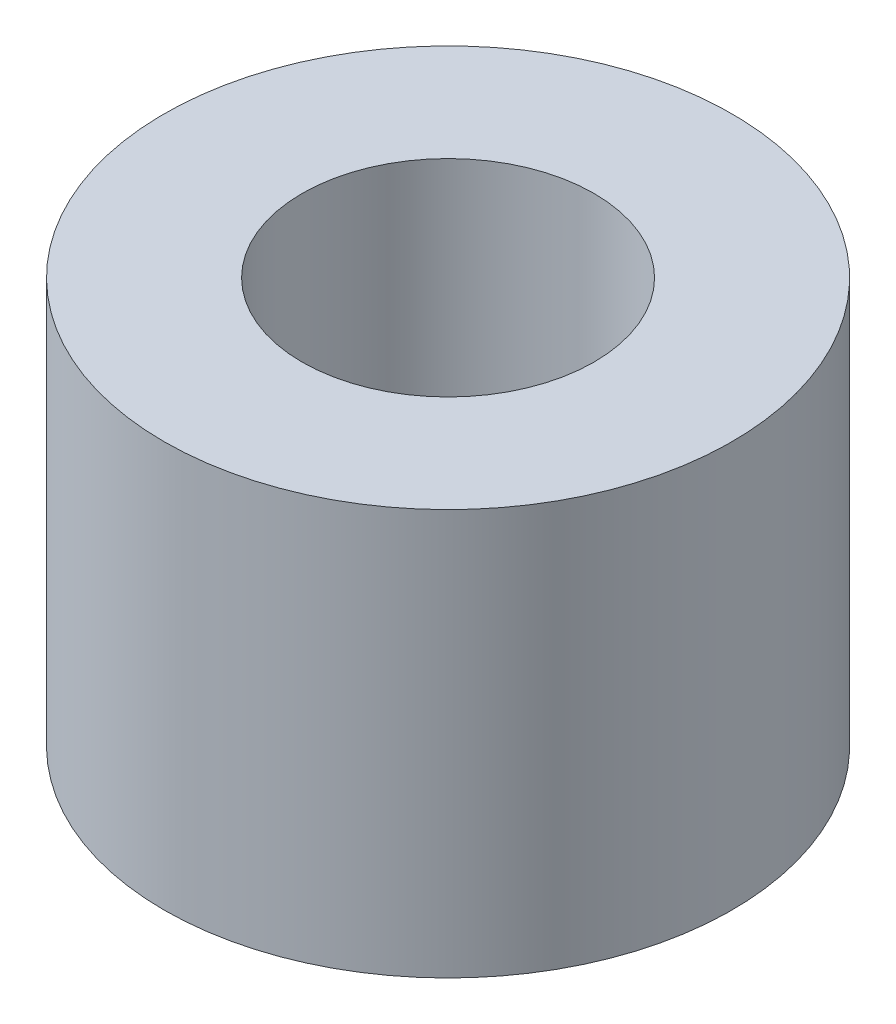
ISO-10303-21;
HEADER;
FILE_DESCRIPTION(('STEP AP214'),'2;1');
FILE_NAME('part.step','',(''),(''),'','','');
FILE_SCHEMA(('AUTOMOTIVE_DESIGN { 1 0 10303 214 1 1 1 1 }'));
ENDSEC;
DATA;
#1=APPLICATION_CONTEXT('core data for automotive mechanical design processes');
#2=APPLICATION_PROTOCOL_DEFINITION('international standard','automotive_design',2000,#1);
#3=PRODUCT_CONTEXT('',#1,'mechanical');
#4=PRODUCT('Part','Part','',(#3));
#5=PRODUCT_RELATED_PRODUCT_CATEGORY('part','',(#4));
#6=PRODUCT_DEFINITION_FORMATION('','',#4);
#7=PRODUCT_DEFINITION_CONTEXT('part definition',#1,'design');
#8=PRODUCT_DEFINITION('design','',#6,#7);
#9=PRODUCT_DEFINITION_SHAPE('','',#8);
#10=(LENGTH_UNIT() NAMED_UNIT(*) SI_UNIT(.MILLI.,.METRE.));
#11=(NAMED_UNIT(*) PLANE_ANGLE_UNIT() SI_UNIT($,.RADIAN.));
#12=(NAMED_UNIT(*) SI_UNIT($,.STERADIAN.) SOLID_ANGLE_UNIT());
#13=UNCERTAINTY_MEASURE_WITH_UNIT(LENGTH_MEASURE(1.E-05),#10,'distance_accuracy_value','');
#14=(GEOMETRIC_REPRESENTATION_CONTEXT(3) GLOBAL_UNCERTAINTY_ASSIGNED_CONTEXT((#13)) GLOBAL_UNIT_ASSIGNED_CONTEXT((#10,
#11,#12)) REPRESENTATION_CONTEXT('',''));
#15=CARTESIAN_POINT('',(0.,0.,0.));
#16=DIRECTION('',(0.,0.,1.));
#17=DIRECTION('',(1.,0.,0.));
#18=AXIS2_PLACEMENT_3D('',#15,#16,#17);
#19=CARTESIAN_POINT('',(0.,2.5,0.));
#20=DIRECTION('',(0.,1.,0.));
#21=DIRECTION('',(0.,0.,1.));
#22=AXIS2_PLACEMENT_3D('',#19,#20,#21);
#23=PLANE('',#22);
#24=CARTESIAN_POINT('',(0.,2.5,0.));
#25=DIRECTION('',(0.,1.,0.));
#26=DIRECTION('',(0.,0.,1.));
#27=AXIS2_PLACEMENT_3D('',#24,#25,#26);
#28=CIRCLE('',#27,3.5);
#29=CARTESIAN_POINT('',(0.,2.5,3.5));
#30=VERTEX_POINT('',#29);
#31=EDGE_CURVE('E10',#30,#30,#28,.T.);
#32=ORIENTED_EDGE('',*,*,#31,.T.);
#33=EDGE_LOOP('',(#32));
#34=FACE_BOUND('',#33,.T.);
#35=CARTESIAN_POINT('',(0.,2.5,0.));
#36=DIRECTION('',(0.,1.,0.));
#37=DIRECTION('',(0.,0.,1.));
#38=AXIS2_PLACEMENT_3D('',#35,#36,#37);
#39=CIRCLE('',#38,1.8);
#40=CARTESIAN_POINT('',(0.,2.5,1.8));
#41=VERTEX_POINT('',#40);
#42=EDGE_CURVE('E48',#41,#41,#39,.T.);
#43=ORIENTED_EDGE('',*,*,#42,.F.);
#44=EDGE_LOOP('',(#43));
#45=FACE_BOUND('',#44,.T.);
#46=ADVANCED_FACE('F37',(#34,#45),#23,.T.);
#47=CARTESIAN_POINT('',(0.,-2.5,0.));
#48=DIRECTION('',(0.,1.,0.));
#49=DIRECTION('',(0.,0.,1.));
#50=AXIS2_PLACEMENT_3D('',#47,#48,#49);
#51=PLANE('',#50);
#52=CARTESIAN_POINT('',(0.,-2.5,0.));
#53=DIRECTION('',(0.,1.,0.));
#54=DIRECTION('',(0.,0.,1.));
#55=AXIS2_PLACEMENT_3D('',#52,#53,#54);
#56=CIRCLE('',#55,3.5);
#57=CARTESIAN_POINT('',(0.,-2.5,3.5));
#58=VERTEX_POINT('',#57);
#59=EDGE_CURVE('E41',#58,#58,#56,.T.);
#60=ORIENTED_EDGE('',*,*,#59,.F.);
#61=EDGE_LOOP('',(#60));
#62=FACE_BOUND('',#61,.T.);
#63=CARTESIAN_POINT('',(0.,-2.5,0.));
#64=DIRECTION('',(0.,1.,0.));
#65=DIRECTION('',(0.,0.,1.));
#66=AXIS2_PLACEMENT_3D('',#63,#64,#65);
#67=CIRCLE('',#66,1.8);
#68=CARTESIAN_POINT('',(0.,-2.5,1.8));
#69=VERTEX_POINT('',#68);
#70=EDGE_CURVE('E50',#69,#69,#67,.T.);
#71=ORIENTED_EDGE('',*,*,#70,.T.);
#72=EDGE_LOOP('',(#71));
#73=FACE_BOUND('',#72,.T.);
#74=ADVANCED_FACE('F60',(#62,#73),#51,.F.);
#75=CARTESIAN_POINT('',(0.,2.5,0.));
#76=DIRECTION('',(0.,-1.,0.));
#77=DIRECTION('',(0.,0.,-1.));
#78=AXIS2_PLACEMENT_3D('',#75,#76,#77);
#79=CYLINDRICAL_SURFACE('',#78,3.5);
#80=ORIENTED_EDGE('',*,*,#31,.F.);
#81=EDGE_LOOP('',(#80));
#82=FACE_BOUND('',#81,.T.);
#83=ORIENTED_EDGE('',*,*,#59,.T.);
#84=EDGE_LOOP('',(#83));
#85=FACE_BOUND('',#84,.T.);
#86=ADVANCED_FACE('F39',(#82,#85),#79,.T.);
#87=CARTESIAN_POINT('',(0.,2.5,0.));
#88=DIRECTION('',(0.,-1.,0.));
#89=DIRECTION('',(0.,0.,-1.));
#90=AXIS2_PLACEMENT_3D('',#87,#88,#89);
#91=CYLINDRICAL_SURFACE('',#90,1.8);
#92=ORIENTED_EDGE('',*,*,#42,.T.);
#93=EDGE_LOOP('',(#92));
#94=FACE_BOUND('',#93,.T.);
#95=ORIENTED_EDGE('',*,*,#70,.F.);
#96=EDGE_LOOP('',(#95));
#97=FACE_BOUND('',#96,.T.);
#98=ADVANCED_FACE('F56',(#94,#97),#91,.F.);
#99=CLOSED_SHELL('',(#46,#74,#86,#98));
#100=MANIFOLD_SOLID_BREP('B2',#99);
#101=ADVANCED_BREP_SHAPE_REPRESENTATION('',(#18,#100),#14);
#102=SHAPE_DEFINITION_REPRESENTATION(#9,#101);
ENDSEC;
END-ISO-10303-21;
